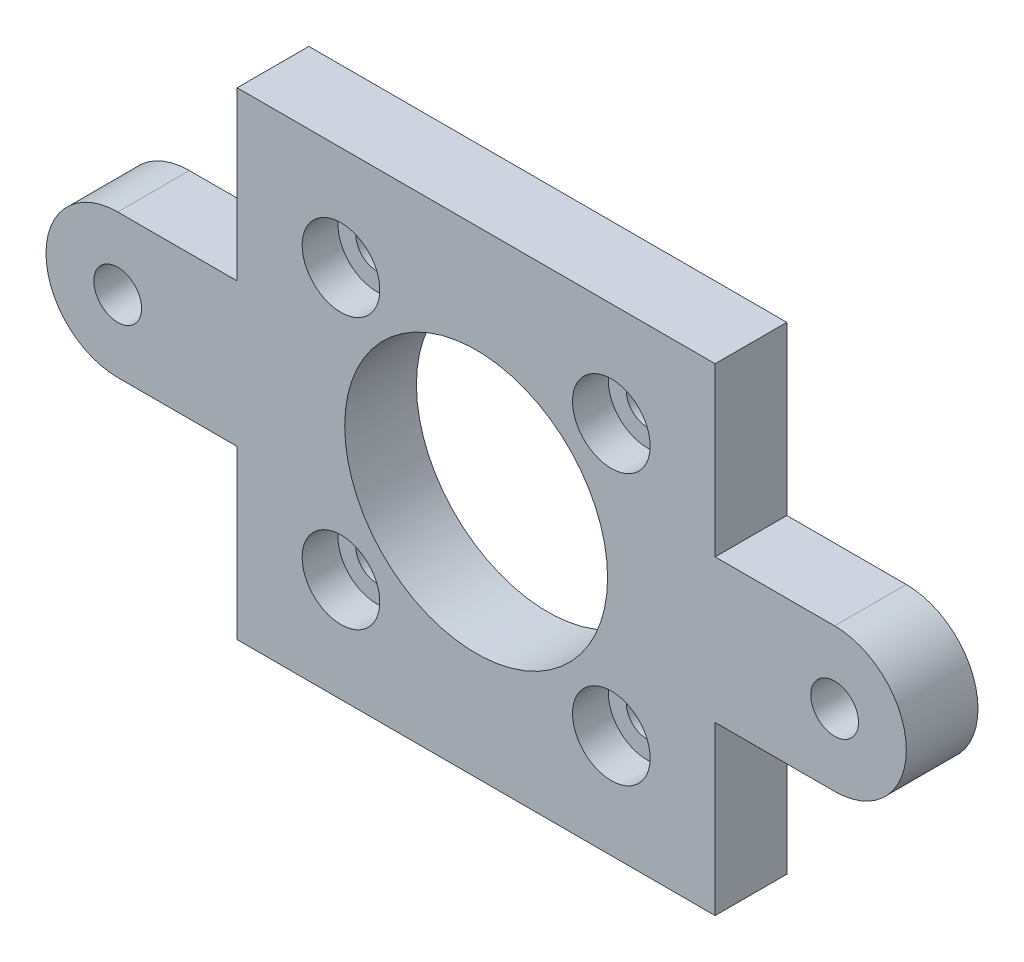
ISO-10303-21;
HEADER;
FILE_DESCRIPTION(('STEP AP214'),'2;1');
FILE_NAME('part.step','',(''),(''),'','','');
FILE_SCHEMA(('AUTOMOTIVE_DESIGN { 1 0 10303 214 1 1 1 1 }'));
ENDSEC;
DATA;
#1=APPLICATION_CONTEXT('core data for automotive mechanical design processes');
#2=APPLICATION_PROTOCOL_DEFINITION('international standard','automotive_design',2000,#1);
#3=PRODUCT_CONTEXT('',#1,'mechanical');
#4=PRODUCT('Part','Part','',(#3));
#5=PRODUCT_RELATED_PRODUCT_CATEGORY('part','',(#4));
#6=PRODUCT_DEFINITION_FORMATION('','',#4);
#7=PRODUCT_DEFINITION_CONTEXT('part definition',#1,'design');
#8=PRODUCT_DEFINITION('design','',#6,#7);
#9=PRODUCT_DEFINITION_SHAPE('','',#8);
#10=(LENGTH_UNIT() NAMED_UNIT(*) SI_UNIT(.MILLI.,.METRE.));
#11=(NAMED_UNIT(*) PLANE_ANGLE_UNIT() SI_UNIT($,.RADIAN.));
#12=(NAMED_UNIT(*) SI_UNIT($,.STERADIAN.) SOLID_ANGLE_UNIT());
#13=UNCERTAINTY_MEASURE_WITH_UNIT(LENGTH_MEASURE(1.E-05),#10,'distance_accuracy_value','');
#14=(GEOMETRIC_REPRESENTATION_CONTEXT(3) GLOBAL_UNCERTAINTY_ASSIGNED_CONTEXT((#13)) GLOBAL_UNIT_ASSIGNED_CONTEXT((#10,
#11,#12)) REPRESENTATION_CONTEXT('',''));
#15=CARTESIAN_POINT('',(0.,0.,0.));
#16=DIRECTION('',(0.,0.,1.));
#17=DIRECTION('',(1.,0.,0.));
#18=AXIS2_PLACEMENT_3D('',#15,#16,#17);
#19=CARTESIAN_POINT('',(11.3137084989844,-11.3137084989851,6.));
#20=DIRECTION('',(0.,0.,-1.));
#21=DIRECTION('',(-1.,0.,0.));
#22=AXIS2_PLACEMENT_3D('',#19,#20,#21);
#23=CYLINDRICAL_SURFACE('',#22,3.25);
#24=CARTESIAN_POINT('',(11.3137084989844,-11.3137084989851,3.));
#25=DIRECTION('',(0.,0.,-1.));
#26=DIRECTION('',(-1.,0.,0.));
#27=AXIS2_PLACEMENT_3D('',#24,#25,#26);
#28=CIRCLE('',#27,3.25);
#29=CARTESIAN_POINT('',(8.0637084989844,-11.3137084989851,3.));
#30=VERTEX_POINT('',#29);
#31=EDGE_CURVE('E241',#30,#30,#28,.F.);
#32=ORIENTED_EDGE('',*,*,#31,.F.);
#33=EDGE_LOOP('',(#32));
#34=FACE_BOUND('',#33,.T.);
#35=CARTESIAN_POINT('',(11.3137084989844,-11.3137084989851,6.));
#36=DIRECTION('',(0.,0.,-1.));
#37=DIRECTION('',(-1.,0.,0.));
#38=AXIS2_PLACEMENT_3D('',#35,#36,#37);
#39=CIRCLE('',#38,3.25);
#40=CARTESIAN_POINT('',(8.0637084989844,-11.3137084989851,6.));
#41=VERTEX_POINT('',#40);
#42=EDGE_CURVE('E238',#41,#41,#39,.T.);
#43=ORIENTED_EDGE('',*,*,#42,.F.);
#44=EDGE_LOOP('',(#43));
#45=FACE_BOUND('',#44,.T.);
#46=ADVANCED_FACE('F17',(#34,#45),#23,.F.);
#47=CARTESIAN_POINT('',(-11.3137084989844,11.3137084989851,6.));
#48=DIRECTION('',(0.,0.,-1.));
#49=DIRECTION('',(-1.,0.,0.));
#50=AXIS2_PLACEMENT_3D('',#47,#48,#49);
#51=CYLINDRICAL_SURFACE('',#50,3.25);
#52=CARTESIAN_POINT('',(-11.3137084989844,11.3137084989851,3.));
#53=DIRECTION('',(0.,0.,-1.));
#54=DIRECTION('',(-1.,0.,0.));
#55=AXIS2_PLACEMENT_3D('',#52,#53,#54);
#56=CIRCLE('',#55,3.25);
#57=CARTESIAN_POINT('',(-14.5637084989844,11.3137084989851,3.));
#58=VERTEX_POINT('',#57);
#59=EDGE_CURVE('E246',#58,#58,#56,.F.);
#60=ORIENTED_EDGE('',*,*,#59,.F.);
#61=EDGE_LOOP('',(#60));
#62=FACE_BOUND('',#61,.T.);
#63=CARTESIAN_POINT('',(-11.3137084989844,11.3137084989851,6.));
#64=DIRECTION('',(0.,0.,-1.));
#65=DIRECTION('',(-1.,0.,0.));
#66=AXIS2_PLACEMENT_3D('',#63,#64,#65);
#67=CIRCLE('',#66,3.25);
#68=CARTESIAN_POINT('',(-14.5637084989844,11.3137084989851,6.));
#69=VERTEX_POINT('',#68);
#70=EDGE_CURVE('E235',#69,#69,#67,.T.);
#71=ORIENTED_EDGE('',*,*,#70,.F.);
#72=EDGE_LOOP('',(#71));
#73=FACE_BOUND('',#72,.T.);
#74=ADVANCED_FACE('F260',(#62,#73),#51,.F.);
#75=CARTESIAN_POINT('',(-11.3137084989851,-11.3137084989845,6.));
#76=DIRECTION('',(0.,0.,-1.));
#77=DIRECTION('',(-1.,0.,0.));
#78=AXIS2_PLACEMENT_3D('',#75,#76,#77);
#79=CYLINDRICAL_SURFACE('',#78,3.25);
#80=CARTESIAN_POINT('',(-11.3137084989851,-11.3137084989845,3.));
#81=DIRECTION('',(0.,0.,-1.));
#82=DIRECTION('',(-1.,0.,0.));
#83=AXIS2_PLACEMENT_3D('',#80,#81,#82);
#84=CIRCLE('',#83,3.25);
#85=CARTESIAN_POINT('',(-14.5637084989851,-11.3137084989845,3.));
#86=VERTEX_POINT('',#85);
#87=EDGE_CURVE('E20',#86,#86,#84,.F.);
#88=ORIENTED_EDGE('',*,*,#87,.F.);
#89=EDGE_LOOP('',(#88));
#90=FACE_BOUND('',#89,.T.);
#91=CARTESIAN_POINT('',(-11.3137084989851,-11.3137084989845,6.));
#92=DIRECTION('',(0.,0.,-1.));
#93=DIRECTION('',(-1.,0.,0.));
#94=AXIS2_PLACEMENT_3D('',#91,#92,#93);
#95=CIRCLE('',#94,3.25);
#96=CARTESIAN_POINT('',(-14.5637084989851,-11.3137084989845,6.));
#97=VERTEX_POINT('',#96);
#98=EDGE_CURVE('E232',#97,#97,#95,.T.);
#99=ORIENTED_EDGE('',*,*,#98,.F.);
#100=EDGE_LOOP('',(#99));
#101=FACE_BOUND('',#100,.T.);
#102=ADVANCED_FACE('F256',(#90,#101),#79,.F.);
#103=CARTESIAN_POINT('',(11.3137084989851,11.3137084989844,6.));
#104=DIRECTION('',(0.,0.,-1.));
#105=DIRECTION('',(-1.,0.,0.));
#106=AXIS2_PLACEMENT_3D('',#103,#104,#105);
#107=CYLINDRICAL_SURFACE('',#106,3.25);
#108=CARTESIAN_POINT('',(11.3137084989851,11.3137084989844,3.));
#109=DIRECTION('',(0.,0.,-1.));
#110=DIRECTION('',(-1.,0.,0.));
#111=AXIS2_PLACEMENT_3D('',#108,#109,#110);
#112=CIRCLE('',#111,3.25);
#113=CARTESIAN_POINT('',(8.0637084989851,11.3137084989844,3.));
#114=VERTEX_POINT('',#113);
#115=EDGE_CURVE('E244',#114,#114,#112,.F.);
#116=ORIENTED_EDGE('',*,*,#115,.F.);
#117=EDGE_LOOP('',(#116));
#118=FACE_BOUND('',#117,.T.);
#119=CARTESIAN_POINT('',(11.3137084989851,11.3137084989844,6.));
#120=DIRECTION('',(0.,0.,-1.));
#121=DIRECTION('',(-1.,0.,0.));
#122=AXIS2_PLACEMENT_3D('',#119,#120,#121);
#123=CIRCLE('',#122,3.25);
#124=CARTESIAN_POINT('',(8.0637084989851,11.3137084989844,6.));
#125=VERTEX_POINT('',#124);
#126=EDGE_CURVE('E229',#125,#125,#123,.T.);
#127=ORIENTED_EDGE('',*,*,#126,.F.);
#128=EDGE_LOOP('',(#127));
#129=FACE_BOUND('',#128,.T.);
#130=ADVANCED_FACE('F259',(#118,#129),#107,.F.);
#131=CARTESIAN_POINT('',(-11.3137084989851,-11.3137084989845,3.));
#132=DIRECTION('',(0.,0.,1.));
#133=DIRECTION('',(1.,0.,0.));
#134=AXIS2_PLACEMENT_3D('',#131,#132,#133);
#135=PLANE('',#134);
#136=ORIENTED_EDGE('',*,*,#87,.T.);
#137=EDGE_LOOP('',(#136));
#138=FACE_BOUND('',#137,.T.);
#139=CARTESIAN_POINT('',(-11.3137084989851,-11.3137084989845,3.));
#140=DIRECTION('',(0.,0.,1.));
#141=DIRECTION('',(1.,0.,0.));
#142=AXIS2_PLACEMENT_3D('',#139,#140,#141);
#143=CIRCLE('',#142,1.75);
#144=CARTESIAN_POINT('',(-9.5637084989851,-11.3137084989845,3.));
#145=VERTEX_POINT('',#144);
#146=EDGE_CURVE('E226',#145,#145,#143,.F.);
#147=ORIENTED_EDGE('',*,*,#146,.T.);
#148=EDGE_LOOP('',(#147));
#149=FACE_BOUND('',#148,.T.);
#150=ADVANCED_FACE('F253',(#138,#149),#135,.T.);
#151=CARTESIAN_POINT('',(-11.3137084989844,11.3137084989851,3.));
#152=DIRECTION('',(0.,0.,1.));
#153=DIRECTION('',(1.,0.,0.));
#154=AXIS2_PLACEMENT_3D('',#151,#152,#153);
#155=PLANE('',#154);
#156=ORIENTED_EDGE('',*,*,#59,.T.);
#157=EDGE_LOOP('',(#156));
#158=FACE_BOUND('',#157,.T.);
#159=CARTESIAN_POINT('',(-11.3137084989844,11.3137084989851,3.));
#160=DIRECTION('',(0.,0.,1.));
#161=DIRECTION('',(1.,0.,0.));
#162=AXIS2_PLACEMENT_3D('',#159,#160,#161);
#163=CIRCLE('',#162,1.75);
#164=CARTESIAN_POINT('',(-9.5637084989844,11.3137084989851,3.));
#165=VERTEX_POINT('',#164);
#166=EDGE_CURVE('E223',#165,#165,#163,.F.);
#167=ORIENTED_EDGE('',*,*,#166,.T.);
#168=EDGE_LOOP('',(#167));
#169=FACE_BOUND('',#168,.T.);
#170=ADVANCED_FACE('F321',(#158,#169),#155,.T.);
#171=CARTESIAN_POINT('',(11.3137084989851,11.3137084989844,3.));
#172=DIRECTION('',(0.,0.,1.));
#173=DIRECTION('',(1.,0.,0.));
#174=AXIS2_PLACEMENT_3D('',#171,#172,#173);
#175=PLANE('',#174);
#176=ORIENTED_EDGE('',*,*,#115,.T.);
#177=EDGE_LOOP('',(#176));
#178=FACE_BOUND('',#177,.T.);
#179=CARTESIAN_POINT('',(11.3137084989851,11.3137084989844,3.));
#180=DIRECTION('',(0.,0.,1.));
#181=DIRECTION('',(1.,0.,0.));
#182=AXIS2_PLACEMENT_3D('',#179,#180,#181);
#183=CIRCLE('',#182,1.75);
#184=CARTESIAN_POINT('',(13.0637084989851,11.3137084989844,3.));
#185=VERTEX_POINT('',#184);
#186=EDGE_CURVE('E220',#185,#185,#183,.F.);
#187=ORIENTED_EDGE('',*,*,#186,.T.);
#188=EDGE_LOOP('',(#187));
#189=FACE_BOUND('',#188,.T.);
#190=ADVANCED_FACE('F317',(#178,#189),#175,.T.);
#191=CARTESIAN_POINT('',(11.3137084989845,-11.3137084989851,3.));
#192=DIRECTION('',(0.,0.,1.));
#193=DIRECTION('',(1.,0.,0.));
#194=AXIS2_PLACEMENT_3D('',#191,#192,#193);
#195=PLANE('',#194);
#196=ORIENTED_EDGE('',*,*,#31,.T.);
#197=EDGE_LOOP('',(#196));
#198=FACE_BOUND('',#197,.T.);
#199=CARTESIAN_POINT('',(11.3137084989844,-11.3137084989851,3.));
#200=DIRECTION('',(0.,0.,1.));
#201=DIRECTION('',(1.,0.,0.));
#202=AXIS2_PLACEMENT_3D('',#199,#200,#201);
#203=CIRCLE('',#202,1.75);
#204=CARTESIAN_POINT('',(13.0637084989844,-11.3137084989851,3.));
#205=VERTEX_POINT('',#204);
#206=EDGE_CURVE('E217',#205,#205,#203,.F.);
#207=ORIENTED_EDGE('',*,*,#206,.T.);
#208=EDGE_LOOP('',(#207));
#209=FACE_BOUND('',#208,.T.);
#210=ADVANCED_FACE('F267',(#198,#209),#195,.T.);
#211=CARTESIAN_POINT('',(0.,0.,6.));
#212=DIRECTION('',(0.,0.,1.));
#213=DIRECTION('',(1.,0.,0.));
#214=AXIS2_PLACEMENT_3D('',#211,#212,#213);
#215=PLANE('',#214);
#216=DIRECTION('',(0.,1.,0.));
#217=VECTOR('',#216,1.);
#218=CARTESIAN_POINT('',(20.,6.,6.));
#219=LINE('',#218,#217);
#220=CARTESIAN_POINT('',(20.,20.,6.));
#221=VERTEX_POINT('',#220);
#222=CARTESIAN_POINT('',(20.,6.,6.));
#223=VERTEX_POINT('',#222);
#224=EDGE_CURVE('E150',#221,#223,#219,.F.);
#225=ORIENTED_EDGE('',*,*,#224,.F.);
#226=DIRECTION('',(-1.,0.,0.));
#227=VECTOR('',#226,1.);
#228=CARTESIAN_POINT('',(20.,20.,6.));
#229=LINE('',#228,#227);
#230=CARTESIAN_POINT('',(-20.,20.,6.));
#231=VERTEX_POINT('',#230);
#232=EDGE_CURVE('E145',#231,#221,#229,.F.);
#233=ORIENTED_EDGE('',*,*,#232,.F.);
#234=DIRECTION('',(0.,1.,0.));
#235=VECTOR('',#234,1.);
#236=CARTESIAN_POINT('',(-20.,20.,6.));
#237=LINE('',#236,#235);
#238=CARTESIAN_POINT('',(-20.,6.,6.));
#239=VERTEX_POINT('',#238);
#240=EDGE_CURVE('E140',#239,#231,#237,.T.);
#241=ORIENTED_EDGE('',*,*,#240,.F.);
#242=DIRECTION('',(-1.,0.,0.));
#243=VECTOR('',#242,1.);
#244=CARTESIAN_POINT('',(-20.,6.,6.));
#245=LINE('',#244,#243);
#246=CARTESIAN_POINT('',(-30.,6.,6.));
#247=VERTEX_POINT('',#246);
#248=EDGE_CURVE('E120',#247,#239,#245,.F.);
#249=ORIENTED_EDGE('',*,*,#248,.F.);
#250=CARTESIAN_POINT('',(-30.,0.,6.));
#251=DIRECTION('',(0.,0.,1.));
#252=DIRECTION('',(1.,0.,0.));
#253=AXIS2_PLACEMENT_3D('',#250,#251,#252);
#254=CIRCLE('',#253,6.);
#255=CARTESIAN_POINT('',(-30.,-6.,6.));
#256=VERTEX_POINT('',#255);
#257=EDGE_CURVE('E112',#256,#247,#254,.F.);
#258=ORIENTED_EDGE('',*,*,#257,.F.);
#259=DIRECTION('',(1.,0.,0.));
#260=VECTOR('',#259,1.);
#261=CARTESIAN_POINT('',(-30.,-6.,6.));
#262=LINE('',#261,#260);
#263=CARTESIAN_POINT('',(-20.,-6.,6.));
#264=VERTEX_POINT('',#263);
#265=EDGE_CURVE('E102',#264,#256,#262,.F.);
#266=ORIENTED_EDGE('',*,*,#265,.F.);
#267=DIRECTION('',(0.,-1.,0.));
#268=VECTOR('',#267,1.);
#269=CARTESIAN_POINT('',(-20.,-6.,6.));
#270=LINE('',#269,#268);
#271=CARTESIAN_POINT('',(-20.,-20.,6.));
#272=VERTEX_POINT('',#271);
#273=EDGE_CURVE('E129',#272,#264,#270,.F.);
#274=ORIENTED_EDGE('',*,*,#273,.F.);
#275=DIRECTION('',(1.,0.,0.));
#276=VECTOR('',#275,1.);
#277=CARTESIAN_POINT('',(-20.,-20.,6.));
#278=LINE('',#277,#276);
#279=CARTESIAN_POINT('',(20.,-20.,6.));
#280=VERTEX_POINT('',#279);
#281=EDGE_CURVE('E171',#280,#272,#278,.F.);
#282=ORIENTED_EDGE('',*,*,#281,.F.);
#283=DIRECTION('',(0.,1.,0.));
#284=VECTOR('',#283,1.);
#285=CARTESIAN_POINT('',(20.,-20.,6.));
#286=LINE('',#285,#284);
#287=CARTESIAN_POINT('',(20.,-6.,6.));
#288=VERTEX_POINT('',#287);
#289=EDGE_CURVE('E166',#288,#280,#286,.F.);
#290=ORIENTED_EDGE('',*,*,#289,.F.);
#291=DIRECTION('',(1.,0.,0.));
#292=VECTOR('',#291,1.);
#293=CARTESIAN_POINT('',(20.,-6.,6.));
#294=LINE('',#293,#292);
#295=CARTESIAN_POINT('',(30.,-6.,6.));
#296=VERTEX_POINT('',#295);
#297=EDGE_CURVE('E160',#296,#288,#294,.F.);
#298=ORIENTED_EDGE('',*,*,#297,.F.);
#299=CARTESIAN_POINT('',(30.,0.,6.));
#300=DIRECTION('',(0.,0.,1.));
#301=DIRECTION('',(1.,0.,0.));
#302=AXIS2_PLACEMENT_3D('',#299,#300,#301);
#303=CIRCLE('',#302,6.);
#304=CARTESIAN_POINT('',(30.,6.,6.));
#305=VERTEX_POINT('',#304);
#306=EDGE_CURVE('E157',#305,#296,#303,.F.);
#307=ORIENTED_EDGE('',*,*,#306,.F.);
#308=DIRECTION('',(-1.,0.,0.));
#309=VECTOR('',#308,1.);
#310=CARTESIAN_POINT('',(30.,6.,6.));
#311=LINE('',#310,#309);
#312=EDGE_CURVE('E155',#223,#305,#311,.F.);
#313=ORIENTED_EDGE('',*,*,#312,.F.);
#314=EDGE_LOOP('',(#225,#233,#241,#249,#258,#266,#274,#282,#290,#298,#307,#313));
#315=FACE_BOUND('',#314,.T.);
#316=ORIENTED_EDGE('',*,*,#126,.T.);
#317=EDGE_LOOP('',(#316));
#318=FACE_BOUND('',#317,.T.);
#319=ORIENTED_EDGE('',*,*,#98,.T.);
#320=EDGE_LOOP('',(#319));
#321=FACE_BOUND('',#320,.T.);
#322=ORIENTED_EDGE('',*,*,#70,.T.);
#323=EDGE_LOOP('',(#322));
#324=FACE_BOUND('',#323,.T.);
#325=ORIENTED_EDGE('',*,*,#42,.T.);
#326=EDGE_LOOP('',(#325));
#327=FACE_BOUND('',#326,.T.);
#328=CARTESIAN_POINT('',(0.,0.,6.));
#329=DIRECTION('',(0.,0.,1.));
#330=DIRECTION('',(1.,0.,0.));
#331=AXIS2_PLACEMENT_3D('',#328,#329,#330);
#332=CIRCLE('',#331,11.);
#333=CARTESIAN_POINT('',(11.,0.,6.));
#334=VERTEX_POINT('',#333);
#335=EDGE_CURVE('E124',#334,#334,#332,.F.);
#336=ORIENTED_EDGE('',*,*,#335,.T.);
#337=EDGE_LOOP('',(#336));
#338=FACE_BOUND('',#337,.T.);
#339=CARTESIAN_POINT('',(30.,0.,6.));
#340=DIRECTION('',(0.,0.,1.));
#341=DIRECTION('',(1.,0.,0.));
#342=AXIS2_PLACEMENT_3D('',#339,#340,#341);
#343=CIRCLE('',#342,2.);
#344=CARTESIAN_POINT('',(32.,0.,6.));
#345=VERTEX_POINT('',#344);
#346=EDGE_CURVE('E211',#345,#345,#343,.F.);
#347=ORIENTED_EDGE('',*,*,#346,.T.);
#348=EDGE_LOOP('',(#347));
#349=FACE_BOUND('',#348,.T.);
#350=CARTESIAN_POINT('',(-30.,0.,6.));
#351=DIRECTION('',(0.,0.,1.));
#352=DIRECTION('',(1.,0.,0.));
#353=AXIS2_PLACEMENT_3D('',#350,#351,#352);
#354=CIRCLE('',#353,2.);
#355=CARTESIAN_POINT('',(-28.,0.,6.));
#356=VERTEX_POINT('',#355);
#357=EDGE_CURVE('E214',#356,#356,#354,.F.);
#358=ORIENTED_EDGE('',*,*,#357,.T.);
#359=EDGE_LOOP('',(#358));
#360=FACE_BOUND('',#359,.T.);
#361=ADVANCED_FACE('F117',(#315,#318,#321,#324,#327,#338,#349,#360),#215,.T.);
#362=CARTESIAN_POINT('',(-11.3137084989851,-11.3137084989845,0.));
#363=DIRECTION('',(0.,0.,1.));
#364=DIRECTION('',(1.,0.,0.));
#365=AXIS2_PLACEMENT_3D('',#362,#363,#364);
#366=CYLINDRICAL_SURFACE('',#365,1.75);
#367=ORIENTED_EDGE('',*,*,#146,.F.);
#368=EDGE_LOOP('',(#367));
#369=FACE_BOUND('',#368,.T.);
#370=CARTESIAN_POINT('',(-11.3137084989851,-11.3137084989845,0.));
#371=DIRECTION('',(0.,0.,1.));
#372=DIRECTION('',(1.,0.,0.));
#373=AXIS2_PLACEMENT_3D('',#370,#371,#372);
#374=CIRCLE('',#373,1.75);
#375=CARTESIAN_POINT('',(-9.5637084989851,-11.3137084989845,0.));
#376=VERTEX_POINT('',#375);
#377=EDGE_CURVE('E203',#376,#376,#374,.F.);
#378=ORIENTED_EDGE('',*,*,#377,.T.);
#379=EDGE_LOOP('',(#378));
#380=FACE_BOUND('',#379,.T.);
#381=ADVANCED_FACE('F266',(#369,#380),#366,.F.);
#382=CARTESIAN_POINT('',(-11.3137084989844,11.3137084989851,0.));
#383=DIRECTION('',(0.,0.,1.));
#384=DIRECTION('',(1.,0.,0.));
#385=AXIS2_PLACEMENT_3D('',#382,#383,#384);
#386=CYLINDRICAL_SURFACE('',#385,1.75);
#387=ORIENTED_EDGE('',*,*,#166,.F.);
#388=EDGE_LOOP('',(#387));
#389=FACE_BOUND('',#388,.T.);
#390=CARTESIAN_POINT('',(-11.3137084989844,11.3137084989851,0.));
#391=DIRECTION('',(0.,0.,1.));
#392=DIRECTION('',(1.,0.,0.));
#393=AXIS2_PLACEMENT_3D('',#390,#391,#392);
#394=CIRCLE('',#393,1.75);
#395=CARTESIAN_POINT('',(-9.5637084989844,11.3137084989851,0.));
#396=VERTEX_POINT('',#395);
#397=EDGE_CURVE('E200',#396,#396,#394,.F.);
#398=ORIENTED_EDGE('',*,*,#397,.T.);
#399=EDGE_LOOP('',(#398));
#400=FACE_BOUND('',#399,.T.);
#401=ADVANCED_FACE('F302',(#389,#400),#386,.F.);
#402=CARTESIAN_POINT('',(11.3137084989851,11.3137084989844,0.));
#403=DIRECTION('',(0.,0.,1.));
#404=DIRECTION('',(1.,0.,0.));
#405=AXIS2_PLACEMENT_3D('',#402,#403,#404);
#406=CYLINDRICAL_SURFACE('',#405,1.75);
#407=ORIENTED_EDGE('',*,*,#186,.F.);
#408=EDGE_LOOP('',(#407));
#409=FACE_BOUND('',#408,.T.);
#410=CARTESIAN_POINT('',(11.3137084989851,11.3137084989844,0.));
#411=DIRECTION('',(0.,0.,1.));
#412=DIRECTION('',(1.,0.,0.));
#413=AXIS2_PLACEMENT_3D('',#410,#411,#412);
#414=CIRCLE('',#413,1.75);
#415=CARTESIAN_POINT('',(13.0637084989851,11.3137084989844,0.));
#416=VERTEX_POINT('',#415);
#417=EDGE_CURVE('E197',#416,#416,#414,.F.);
#418=ORIENTED_EDGE('',*,*,#417,.T.);
#419=EDGE_LOOP('',(#418));
#420=FACE_BOUND('',#419,.T.);
#421=ADVANCED_FACE('F309',(#409,#420),#406,.F.);
#422=CARTESIAN_POINT('',(11.3137084989844,-11.3137084989851,0.));
#423=DIRECTION('',(0.,0.,1.));
#424=DIRECTION('',(1.,0.,0.));
#425=AXIS2_PLACEMENT_3D('',#422,#423,#424);
#426=CYLINDRICAL_SURFACE('',#425,1.75);
#427=ORIENTED_EDGE('',*,*,#206,.F.);
#428=EDGE_LOOP('',(#427));
#429=FACE_BOUND('',#428,.T.);
#430=CARTESIAN_POINT('',(11.3137084989844,-11.3137084989851,0.));
#431=DIRECTION('',(0.,0.,1.));
#432=DIRECTION('',(1.,0.,0.));
#433=AXIS2_PLACEMENT_3D('',#430,#431,#432);
#434=CIRCLE('',#433,1.75);
#435=CARTESIAN_POINT('',(13.0637084989844,-11.3137084989851,0.));
#436=VERTEX_POINT('',#435);
#437=EDGE_CURVE('E194',#436,#436,#434,.F.);
#438=ORIENTED_EDGE('',*,*,#437,.T.);
#439=EDGE_LOOP('',(#438));
#440=FACE_BOUND('',#439,.T.);
#441=ADVANCED_FACE('F283',(#429,#440),#426,.F.);
#442=CARTESIAN_POINT('',(-30.,0.,0.));
#443=DIRECTION('',(0.,0.,1.));
#444=DIRECTION('',(1.,0.,0.));
#445=AXIS2_PLACEMENT_3D('',#442,#443,#444);
#446=CYLINDRICAL_SURFACE('',#445,2.);
#447=ORIENTED_EDGE('',*,*,#357,.F.);
#448=EDGE_LOOP('',(#447));
#449=FACE_BOUND('',#448,.T.);
#450=CARTESIAN_POINT('',(-30.,0.,0.));
#451=DIRECTION('',(0.,0.,1.));
#452=DIRECTION('',(1.,0.,0.));
#453=AXIS2_PLACEMENT_3D('',#450,#451,#452);
#454=CIRCLE('',#453,2.);
#455=CARTESIAN_POINT('',(-28.,0.,0.));
#456=VERTEX_POINT('',#455);
#457=EDGE_CURVE('E191',#456,#456,#454,.F.);
#458=ORIENTED_EDGE('',*,*,#457,.T.);
#459=EDGE_LOOP('',(#458));
#460=FACE_BOUND('',#459,.T.);
#461=ADVANCED_FACE('F279',(#449,#460),#446,.F.);
#462=CARTESIAN_POINT('',(30.,0.,0.));
#463=DIRECTION('',(0.,0.,1.));
#464=DIRECTION('',(1.,0.,0.));
#465=AXIS2_PLACEMENT_3D('',#462,#463,#464);
#466=CYLINDRICAL_SURFACE('',#465,2.);
#467=ORIENTED_EDGE('',*,*,#346,.F.);
#468=EDGE_LOOP('',(#467));
#469=FACE_BOUND('',#468,.T.);
#470=CARTESIAN_POINT('',(30.,0.,0.));
#471=DIRECTION('',(0.,0.,1.));
#472=DIRECTION('',(1.,0.,0.));
#473=AXIS2_PLACEMENT_3D('',#470,#471,#472);
#474=CIRCLE('',#473,2.);
#475=CARTESIAN_POINT('',(32.,0.,0.));
#476=VERTEX_POINT('',#475);
#477=EDGE_CURVE('E188',#476,#476,#474,.F.);
#478=ORIENTED_EDGE('',*,*,#477,.T.);
#479=EDGE_LOOP('',(#478));
#480=FACE_BOUND('',#479,.T.);
#481=ADVANCED_FACE('F282',(#469,#480),#466,.F.);
#482=CARTESIAN_POINT('',(0.,0.,0.));
#483=DIRECTION('',(0.,0.,1.));
#484=DIRECTION('',(1.,0.,0.));
#485=AXIS2_PLACEMENT_3D('',#482,#483,#484);
#486=CYLINDRICAL_SURFACE('',#485,11.);
#487=ORIENTED_EDGE('',*,*,#335,.F.);
#488=EDGE_LOOP('',(#487));
#489=FACE_BOUND('',#488,.T.);
#490=CARTESIAN_POINT('',(0.,0.,0.));
#491=DIRECTION('',(0.,0.,1.));
#492=DIRECTION('',(1.,0.,0.));
#493=AXIS2_PLACEMENT_3D('',#490,#491,#492);
#494=CIRCLE('',#493,11.);
#495=CARTESIAN_POINT('',(11.,0.,0.));
#496=VERTEX_POINT('',#495);
#497=EDGE_CURVE('E185',#496,#496,#494,.F.);
#498=ORIENTED_EDGE('',*,*,#497,.T.);
#499=EDGE_LOOP('',(#498));
#500=FACE_BOUND('',#499,.T.);
#501=ADVANCED_FACE('F353',(#489,#500),#486,.F.);
#502=CARTESIAN_POINT('',(-30.,0.,0.));
#503=DIRECTION('',(0.,0.,1.));
#504=DIRECTION('',(1.,0.,0.));
#505=AXIS2_PLACEMENT_3D('',#502,#503,#504);
#506=CYLINDRICAL_SURFACE('',#505,6.);
#507=CARTESIAN_POINT('',(-30.,0.,0.));
#508=DIRECTION('',(0.,0.,1.));
#509=DIRECTION('',(1.,0.,0.));
#510=AXIS2_PLACEMENT_3D('',#507,#508,#509);
#511=CIRCLE('',#510,6.);
#512=CARTESIAN_POINT('',(-30.,6.,0.));
#513=VERTEX_POINT('',#512);
#514=CARTESIAN_POINT('',(-30.,-6.,0.));
#515=VERTEX_POINT('',#514);
#516=EDGE_CURVE('E128',#513,#515,#511,.T.);
#517=ORIENTED_EDGE('',*,*,#516,.T.);
#518=DIRECTION('',(0.,0.,1.));
#519=VECTOR('',#518,1.);
#520=CARTESIAN_POINT('',(-30.,-6.,0.));
#521=LINE('',#520,#519);
#522=EDGE_CURVE('E107',#256,#515,#521,.F.);
#523=ORIENTED_EDGE('',*,*,#522,.F.);
#524=ORIENTED_EDGE('',*,*,#257,.T.);
#525=DIRECTION('',(0.,0.,1.));
#526=VECTOR('',#525,1.);
#527=CARTESIAN_POINT('',(-30.,6.,0.));
#528=LINE('',#527,#526);
#529=EDGE_CURVE('E206',#513,#247,#528,.T.);
#530=ORIENTED_EDGE('',*,*,#529,.F.);
#531=EDGE_LOOP('',(#517,#523,#524,#530));
#532=FACE_BOUND('',#531,.T.);
#533=ADVANCED_FACE('F127',(#532),#506,.T.);
#534=CARTESIAN_POINT('',(-30.,-6.,0.));
#535=DIRECTION('',(0.,-1.,0.));
#536=DIRECTION('',(1.,0.,0.));
#537=AXIS2_PLACEMENT_3D('',#534,#535,#536);
#538=PLANE('',#537);
#539=DIRECTION('',(1.,0.,0.));
#540=VECTOR('',#539,1.);
#541=CARTESIAN_POINT('',(0.,-6.,0.));
#542=LINE('',#541,#540);
#543=CARTESIAN_POINT('',(-20.,-6.,0.));
#544=VERTEX_POINT('',#543);
#545=EDGE_CURVE('E184',#515,#544,#542,.T.);
#546=ORIENTED_EDGE('',*,*,#545,.T.);
#547=DIRECTION('',(0.,0.,1.));
#548=VECTOR('',#547,1.);
#549=CARTESIAN_POINT('',(-20.,-6.,0.));
#550=LINE('',#549,#548);
#551=EDGE_CURVE('E109',#264,#544,#550,.F.);
#552=ORIENTED_EDGE('',*,*,#551,.F.);
#553=ORIENTED_EDGE('',*,*,#265,.T.);
#554=ORIENTED_EDGE('',*,*,#522,.T.);
#555=EDGE_LOOP('',(#546,#552,#553,#554));
#556=FACE_BOUND('',#555,.T.);
#557=ADVANCED_FACE('F105',(#556),#538,.T.);
#558=CARTESIAN_POINT('',(-20.,-6.,0.));
#559=DIRECTION('',(-1.,0.,0.));
#560=DIRECTION('',(0.,-1.,0.));
#561=AXIS2_PLACEMENT_3D('',#558,#559,#560);
#562=PLANE('',#561);
#563=DIRECTION('',(0.,1.,0.));
#564=VECTOR('',#563,1.);
#565=CARTESIAN_POINT('',(-20.,0.,0.));
#566=LINE('',#565,#564);
#567=CARTESIAN_POINT('',(-20.,-20.,0.));
#568=VERTEX_POINT('',#567);
#569=EDGE_CURVE('E449',#544,#568,#566,.F.);
#570=ORIENTED_EDGE('',*,*,#569,.T.);
#571=DIRECTION('',(0.,0.,-1.));
#572=VECTOR('',#571,1.);
#573=CARTESIAN_POINT('',(-20.,-20.,0.));
#574=LINE('',#573,#572);
#575=EDGE_CURVE('E168',#272,#568,#574,.T.);
#576=ORIENTED_EDGE('',*,*,#575,.F.);
#577=ORIENTED_EDGE('',*,*,#273,.T.);
#578=ORIENTED_EDGE('',*,*,#551,.T.);
#579=EDGE_LOOP('',(#570,#576,#577,#578));
#580=FACE_BOUND('',#579,.T.);
#581=ADVANCED_FACE('F362',(#580),#562,.T.);
#582=CARTESIAN_POINT('',(-20.,-20.,0.));
#583=DIRECTION('',(0.,-1.,0.));
#584=DIRECTION('',(0.,0.,-1.));
#585=AXIS2_PLACEMENT_3D('',#582,#583,#584);
#586=PLANE('',#585);
#587=DIRECTION('',(1.,0.,0.));
#588=VECTOR('',#587,1.);
#589=CARTESIAN_POINT('',(0.,-20.,0.));
#590=LINE('',#589,#588);
#591=CARTESIAN_POINT('',(20.,-20.,0.));
#592=VERTEX_POINT('',#591);
#593=EDGE_CURVE('E441',#568,#592,#590,.T.);
#594=ORIENTED_EDGE('',*,*,#593,.T.);
#595=DIRECTION('',(0.,0.,1.));
#596=VECTOR('',#595,1.);
#597=CARTESIAN_POINT('',(20.,-20.,0.));
#598=LINE('',#597,#596);
#599=EDGE_CURVE('E163',#280,#592,#598,.F.);
#600=ORIENTED_EDGE('',*,*,#599,.F.);
#601=ORIENTED_EDGE('',*,*,#281,.T.);
#602=ORIENTED_EDGE('',*,*,#575,.T.);
#603=EDGE_LOOP('',(#594,#600,#601,#602));
#604=FACE_BOUND('',#603,.T.);
#605=ADVANCED_FACE('F365',(#604),#586,.T.);
#606=CARTESIAN_POINT('',(20.,-20.,0.));
#607=DIRECTION('',(1.,0.,0.));
#608=DIRECTION('',(0.,1.,0.));
#609=AXIS2_PLACEMENT_3D('',#606,#607,#608);
#610=PLANE('',#609);
#611=DIRECTION('',(0.,1.,0.));
#612=VECTOR('',#611,1.);
#613=CARTESIAN_POINT('',(20.,0.,0.));
#614=LINE('',#613,#612);
#615=CARTESIAN_POINT('',(20.,-6.,0.));
#616=VERTEX_POINT('',#615);
#617=EDGE_CURVE('E438',#592,#616,#614,.T.);
#618=ORIENTED_EDGE('',*,*,#617,.T.);
#619=DIRECTION('',(0.,0.,1.));
#620=VECTOR('',#619,1.);
#621=CARTESIAN_POINT('',(20.,-6.,0.));
#622=LINE('',#621,#620);
#623=EDGE_CURVE('E162',#288,#616,#622,.F.);
#624=ORIENTED_EDGE('',*,*,#623,.F.);
#625=ORIENTED_EDGE('',*,*,#289,.T.);
#626=ORIENTED_EDGE('',*,*,#599,.T.);
#627=EDGE_LOOP('',(#618,#624,#625,#626));
#628=FACE_BOUND('',#627,.T.);
#629=ADVANCED_FACE('F369',(#628),#610,.T.);
#630=CARTESIAN_POINT('',(20.,-6.,0.));
#631=DIRECTION('',(0.,-1.,0.));
#632=DIRECTION('',(1.,0.,0.));
#633=AXIS2_PLACEMENT_3D('',#630,#631,#632);
#634=PLANE('',#633);
#635=DIRECTION('',(1.,0.,0.));
#636=VECTOR('',#635,1.);
#637=CARTESIAN_POINT('',(0.,-6.,0.));
#638=LINE('',#637,#636);
#639=CARTESIAN_POINT('',(30.,-6.,0.));
#640=VERTEX_POINT('',#639);
#641=EDGE_CURVE('E182',#616,#640,#638,.T.);
#642=ORIENTED_EDGE('',*,*,#641,.T.);
#643=DIRECTION('',(0.,0.,1.));
#644=VECTOR('',#643,1.);
#645=CARTESIAN_POINT('',(30.,-5.99999999999999,0.));
#646=LINE('',#645,#644);
#647=EDGE_CURVE('E207',#296,#640,#646,.F.);
#648=ORIENTED_EDGE('',*,*,#647,.F.);
#649=ORIENTED_EDGE('',*,*,#297,.T.);
#650=ORIENTED_EDGE('',*,*,#623,.T.);
#651=EDGE_LOOP('',(#642,#648,#649,#650));
#652=FACE_BOUND('',#651,.T.);
#653=ADVANCED_FACE('F373',(#652),#634,.T.);
#654=CARTESIAN_POINT('',(30.,0.,0.));
#655=DIRECTION('',(0.,0.,1.));
#656=DIRECTION('',(1.,0.,0.));
#657=AXIS2_PLACEMENT_3D('',#654,#655,#656);
#658=CYLINDRICAL_SURFACE('',#657,6.);
#659=DIRECTION('',(0.,0.,1.));
#660=VECTOR('',#659,1.);
#661=CARTESIAN_POINT('',(30.,6.,0.));
#662=LINE('',#661,#660);
#663=CARTESIAN_POINT('',(30.,6.,0.));
#664=VERTEX_POINT('',#663);
#665=EDGE_CURVE('E152',#305,#664,#662,.F.);
#666=ORIENTED_EDGE('',*,*,#665,.F.);
#667=ORIENTED_EDGE('',*,*,#306,.T.);
#668=ORIENTED_EDGE('',*,*,#647,.T.);
#669=CARTESIAN_POINT('',(30.,0.,0.));
#670=DIRECTION('',(0.,0.,1.));
#671=DIRECTION('',(1.,0.,0.));
#672=AXIS2_PLACEMENT_3D('',#669,#670,#671);
#673=CIRCLE('',#672,6.);
#674=EDGE_CURVE('E179',#640,#664,#673,.T.);
#675=ORIENTED_EDGE('',*,*,#674,.T.);
#676=EDGE_LOOP('',(#666,#667,#668,#675));
#677=FACE_BOUND('',#676,.T.);
#678=ADVANCED_FACE('F377',(#677),#658,.T.);
#679=CARTESIAN_POINT('',(30.,6.,0.));
#680=DIRECTION('',(0.,1.,0.));
#681=DIRECTION('',(-1.,0.,0.));
#682=AXIS2_PLACEMENT_3D('',#679,#680,#681);
#683=PLANE('',#682);
#684=DIRECTION('',(1.,0.,0.));
#685=VECTOR('',#684,1.);
#686=CARTESIAN_POINT('',(0.,6.,0.));
#687=LINE('',#686,#685);
#688=CARTESIAN_POINT('',(20.,6.,0.));
#689=VERTEX_POINT('',#688);
#690=EDGE_CURVE('E181',#664,#689,#687,.F.);
#691=ORIENTED_EDGE('',*,*,#690,.T.);
#692=DIRECTION('',(0.,0.,1.));
#693=VECTOR('',#692,1.);
#694=CARTESIAN_POINT('',(20.,6.,0.));
#695=LINE('',#694,#693);
#696=EDGE_CURVE('E147',#223,#689,#695,.F.);
#697=ORIENTED_EDGE('',*,*,#696,.F.);
#698=ORIENTED_EDGE('',*,*,#312,.T.);
#699=ORIENTED_EDGE('',*,*,#665,.T.);
#700=EDGE_LOOP('',(#691,#697,#698,#699));
#701=FACE_BOUND('',#700,.T.);
#702=ADVANCED_FACE('F381',(#701),#683,.T.);
#703=CARTESIAN_POINT('',(20.,6.,0.));
#704=DIRECTION('',(1.,0.,0.));
#705=DIRECTION('',(0.,1.,0.));
#706=AXIS2_PLACEMENT_3D('',#703,#704,#705);
#707=PLANE('',#706);
#708=DIRECTION('',(0.,1.,0.));
#709=VECTOR('',#708,1.);
#710=CARTESIAN_POINT('',(20.,0.,0.));
#711=LINE('',#710,#709);
#712=CARTESIAN_POINT('',(20.,20.,0.));
#713=VERTEX_POINT('',#712);
#714=EDGE_CURVE('E409',#689,#713,#711,.T.);
#715=ORIENTED_EDGE('',*,*,#714,.T.);
#716=DIRECTION('',(0.,0.,1.));
#717=VECTOR('',#716,1.);
#718=CARTESIAN_POINT('',(20.,20.,0.));
#719=LINE('',#718,#717);
#720=EDGE_CURVE('E142',#221,#713,#719,.F.);
#721=ORIENTED_EDGE('',*,*,#720,.F.);
#722=ORIENTED_EDGE('',*,*,#224,.T.);
#723=ORIENTED_EDGE('',*,*,#696,.T.);
#724=EDGE_LOOP('',(#715,#721,#722,#723));
#725=FACE_BOUND('',#724,.T.);
#726=ADVANCED_FACE('F385',(#725),#707,.T.);
#727=CARTESIAN_POINT('',(20.,20.,0.));
#728=DIRECTION('',(0.,1.,0.));
#729=DIRECTION('',(-1.,0.,0.));
#730=AXIS2_PLACEMENT_3D('',#727,#728,#729);
#731=PLANE('',#730);
#732=DIRECTION('',(1.,0.,0.));
#733=VECTOR('',#732,1.);
#734=CARTESIAN_POINT('',(0.,20.,0.));
#735=LINE('',#734,#733);
#736=CARTESIAN_POINT('',(-20.,20.,0.));
#737=VERTEX_POINT('',#736);
#738=EDGE_CURVE('E407',#713,#737,#735,.F.);
#739=ORIENTED_EDGE('',*,*,#738,.T.);
#740=DIRECTION('',(0.,0.,1.));
#741=VECTOR('',#740,1.);
#742=CARTESIAN_POINT('',(-20.,20.,0.));
#743=LINE('',#742,#741);
#744=EDGE_CURVE('E137',#231,#737,#743,.F.);
#745=ORIENTED_EDGE('',*,*,#744,.F.);
#746=ORIENTED_EDGE('',*,*,#232,.T.);
#747=ORIENTED_EDGE('',*,*,#720,.T.);
#748=EDGE_LOOP('',(#739,#745,#746,#747));
#749=FACE_BOUND('',#748,.T.);
#750=ADVANCED_FACE('F389',(#749),#731,.T.);
#751=CARTESIAN_POINT('',(-20.,20.,0.));
#752=DIRECTION('',(-1.,0.,0.));
#753=DIRECTION('',(0.,0.,1.));
#754=AXIS2_PLACEMENT_3D('',#751,#752,#753);
#755=PLANE('',#754);
#756=DIRECTION('',(0.,1.,0.));
#757=VECTOR('',#756,1.);
#758=CARTESIAN_POINT('',(-20.,0.,0.));
#759=LINE('',#758,#757);
#760=CARTESIAN_POINT('',(-20.,6.,0.));
#761=VERTEX_POINT('',#760);
#762=EDGE_CURVE('E26',#737,#761,#759,.F.);
#763=ORIENTED_EDGE('',*,*,#762,.T.);
#764=DIRECTION('',(0.,0.,1.));
#765=VECTOR('',#764,1.);
#766=CARTESIAN_POINT('',(-20.,6.,0.));
#767=LINE('',#766,#765);
#768=EDGE_CURVE('E34',#239,#761,#767,.F.);
#769=ORIENTED_EDGE('',*,*,#768,.F.);
#770=ORIENTED_EDGE('',*,*,#240,.T.);
#771=ORIENTED_EDGE('',*,*,#744,.T.);
#772=EDGE_LOOP('',(#763,#769,#770,#771));
#773=FACE_BOUND('',#772,.T.);
#774=ADVANCED_FACE('F393',(#773),#755,.T.);
#775=CARTESIAN_POINT('',(-20.,6.,0.));
#776=DIRECTION('',(0.,1.,0.));
#777=DIRECTION('',(-1.,0.,0.));
#778=AXIS2_PLACEMENT_3D('',#775,#776,#777);
#779=PLANE('',#778);
#780=DIRECTION('',(1.,0.,0.));
#781=VECTOR('',#780,1.);
#782=CARTESIAN_POINT('',(0.,6.,0.));
#783=LINE('',#782,#781);
#784=EDGE_CURVE('E11',#761,#513,#783,.F.);
#785=ORIENTED_EDGE('',*,*,#784,.T.);
#786=ORIENTED_EDGE('',*,*,#529,.T.);
#787=ORIENTED_EDGE('',*,*,#248,.T.);
#788=ORIENTED_EDGE('',*,*,#768,.T.);
#789=EDGE_LOOP('',(#785,#786,#787,#788));
#790=FACE_BOUND('',#789,.T.);
#791=ADVANCED_FACE('F290',(#790),#779,.T.);
#792=CARTESIAN_POINT('',(0.,0.,0.));
#793=DIRECTION('',(0.,0.,1.));
#794=DIRECTION('',(1.,0.,0.));
#795=AXIS2_PLACEMENT_3D('',#792,#793,#794);
#796=PLANE('',#795);
#797=ORIENTED_EDGE('',*,*,#762,.F.);
#798=ORIENTED_EDGE('',*,*,#738,.F.);
#799=ORIENTED_EDGE('',*,*,#714,.F.);
#800=ORIENTED_EDGE('',*,*,#690,.F.);
#801=ORIENTED_EDGE('',*,*,#674,.F.);
#802=ORIENTED_EDGE('',*,*,#641,.F.);
#803=ORIENTED_EDGE('',*,*,#617,.F.);
#804=ORIENTED_EDGE('',*,*,#593,.F.);
#805=ORIENTED_EDGE('',*,*,#569,.F.);
#806=ORIENTED_EDGE('',*,*,#545,.F.);
#807=ORIENTED_EDGE('',*,*,#516,.F.);
#808=ORIENTED_EDGE('',*,*,#784,.F.);
#809=EDGE_LOOP('',(#797,#798,#799,#800,#801,#802,#803,#804,#805,#806,#807,#808));
#810=FACE_BOUND('',#809,.T.);
#811=ORIENTED_EDGE('',*,*,#497,.F.);
#812=EDGE_LOOP('',(#811));
#813=FACE_BOUND('',#812,.T.);
#814=ORIENTED_EDGE('',*,*,#477,.F.);
#815=EDGE_LOOP('',(#814));
#816=FACE_BOUND('',#815,.T.);
#817=ORIENTED_EDGE('',*,*,#457,.F.);
#818=EDGE_LOOP('',(#817));
#819=FACE_BOUND('',#818,.T.);
#820=ORIENTED_EDGE('',*,*,#437,.F.);
#821=EDGE_LOOP('',(#820));
#822=FACE_BOUND('',#821,.T.);
#823=ORIENTED_EDGE('',*,*,#417,.F.);
#824=EDGE_LOOP('',(#823));
#825=FACE_BOUND('',#824,.T.);
#826=ORIENTED_EDGE('',*,*,#397,.F.);
#827=EDGE_LOOP('',(#826));
#828=FACE_BOUND('',#827,.T.);
#829=ORIENTED_EDGE('',*,*,#377,.F.);
#830=EDGE_LOOP('',(#829));
#831=FACE_BOUND('',#830,.T.);
#832=ADVANCED_FACE('F287',(#810,#813,#816,#819,#822,#825,#828,#831),#796,.F.);
#833=CLOSED_SHELL('',(#46,#74,#102,#130,#150,#170,#190,#210,#361,#381,#401,#421,#441,#461,#481,
#501,#533,#557,#581,#605,#629,#653,#678,#702,#726,#750,#774,#791,#832));
#834=MANIFOLD_SOLID_BREP('B1',#833);
#835=ADVANCED_BREP_SHAPE_REPRESENTATION('',(#18,#834),#14);
#836=SHAPE_DEFINITION_REPRESENTATION(#9,#835);
ENDSEC;
END-ISO-10303-21;
